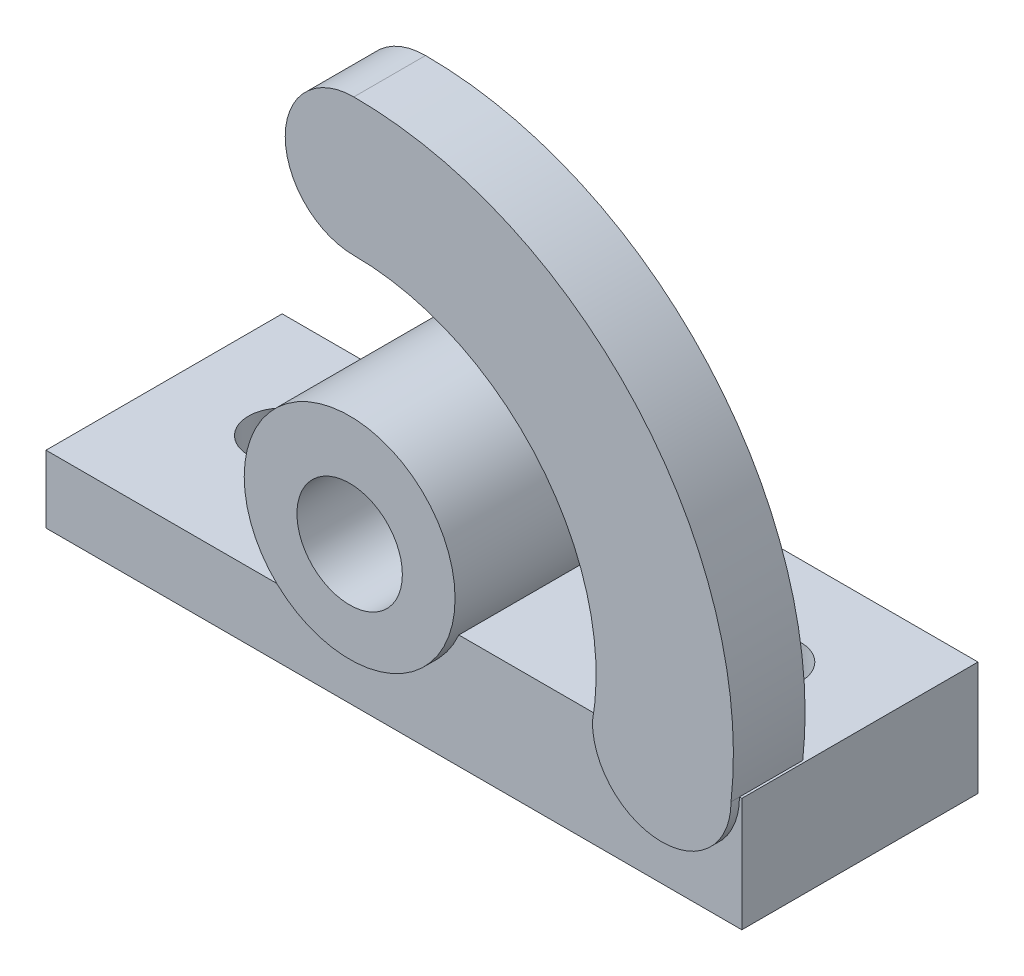
ISO-10303-21;
HEADER;
FILE_DESCRIPTION(('STEP AP214'),'2;1');
FILE_NAME('part.step','',(''),(''),'','','');
FILE_SCHEMA(('AUTOMOTIVE_DESIGN { 1 0 10303 214 1 1 1 1 }'));
ENDSEC;
DATA;
#1=APPLICATION_CONTEXT('core data for automotive mechanical design processes');
#2=APPLICATION_PROTOCOL_DEFINITION('international standard','automotive_design',2000,#1);
#3=PRODUCT_CONTEXT('',#1,'mechanical');
#4=PRODUCT('Part','Part','',(#3));
#5=PRODUCT_RELATED_PRODUCT_CATEGORY('part','',(#4));
#6=PRODUCT_DEFINITION_FORMATION('','',#4);
#7=PRODUCT_DEFINITION_CONTEXT('part definition',#1,'design');
#8=PRODUCT_DEFINITION('design','',#6,#7);
#9=PRODUCT_DEFINITION_SHAPE('','',#8);
#10=(LENGTH_UNIT() NAMED_UNIT(*) SI_UNIT(.MILLI.,.METRE.));
#11=(NAMED_UNIT(*) PLANE_ANGLE_UNIT() SI_UNIT($,.RADIAN.));
#12=(NAMED_UNIT(*) SI_UNIT($,.STERADIAN.) SOLID_ANGLE_UNIT());
#13=UNCERTAINTY_MEASURE_WITH_UNIT(LENGTH_MEASURE(1.E-05),#10,'distance_accuracy_value','');
#14=(GEOMETRIC_REPRESENTATION_CONTEXT(3) GLOBAL_UNCERTAINTY_ASSIGNED_CONTEXT((#13)) GLOBAL_UNIT_ASSIGNED_CONTEXT((#10,
#11,#12)) REPRESENTATION_CONTEXT('',''));
#15=CARTESIAN_POINT('',(0.,0.,0.));
#16=DIRECTION('',(0.,0.,1.));
#17=DIRECTION('',(1.,0.,0.));
#18=AXIS2_PLACEMENT_3D('',#15,#16,#17);
#19=CARTESIAN_POINT('',(0.,27.,0.));
#20=DIRECTION('',(0.,-1.,0.));
#21=DIRECTION('',(0.,0.,-1.));
#22=AXIS2_PLACEMENT_3D('',#19,#20,#21);
#23=PLANE('',#22);
#24=CARTESIAN_POINT('',(140.,27.,-31.));
#25=DIRECTION('',(0.,1.,0.));
#26=DIRECTION('',(0.,0.,1.));
#27=AXIS2_PLACEMENT_3D('',#24,#25,#26);
#28=CIRCLE('',#27,8.00000000000001);
#29=CARTESIAN_POINT('',(140.,27.,-23.));
#30=VERTEX_POINT('',#29);
#31=EDGE_CURVE('E167',#30,#30,#28,.T.);
#32=ORIENTED_EDGE('',*,*,#31,.F.);
#33=EDGE_LOOP('',(#32));
#34=FACE_BOUND('',#33,.T.);
#35=DIRECTION('',(0.,0.,-1.));
#36=VECTOR('',#35,1.);
#37=CARTESIAN_POINT('',(131.562583971721,27.,2.));
#38=LINE('',#37,#36);
#39=CARTESIAN_POINT('',(131.562583971721,27.,-15.));
#40=VERTEX_POINT('',#39);
#41=CARTESIAN_POINT('',(131.562583971721,27.,0.));
#42=VERTEX_POINT('',#41);
#43=EDGE_CURVE('E12',#40,#42,#38,.F.);
#44=ORIENTED_EDGE('',*,*,#43,.F.);
#45=DIRECTION('',(-1.,0.,0.));
#46=VECTOR('',#45,1.);
#47=CARTESIAN_POINT('',(0.,27.,-15.));
#48=LINE('',#47,#46);
#49=CARTESIAN_POINT('',(164.437416028279,27.,-15.));
#50=VERTEX_POINT('',#49);
#51=EDGE_CURVE('E54',#50,#40,#48,.T.);
#52=ORIENTED_EDGE('',*,*,#51,.F.);
#53=DIRECTION('',(0.,0.,-1.));
#54=VECTOR('',#53,1.);
#55=CARTESIAN_POINT('',(164.437416028279,27.,2.));
#56=LINE('',#55,#54);
#57=CARTESIAN_POINT('',(164.437416028279,27.,0.));
#58=VERTEX_POINT('',#57);
#59=EDGE_CURVE('E47',#58,#50,#56,.T.);
#60=ORIENTED_EDGE('',*,*,#59,.F.);
#61=DIRECTION('',(1.,0.,0.));
#62=VECTOR('',#61,1.);
#63=CARTESIAN_POINT('',(165.,27.,0.));
#64=LINE('',#63,#62);
#65=CARTESIAN_POINT('',(165.,27.,0.));
#66=VERTEX_POINT('',#65);
#67=EDGE_CURVE('E170',#58,#66,#64,.T.);
#68=ORIENTED_EDGE('',*,*,#67,.T.);
#69=DIRECTION('',(0.,0.,-1.));
#70=VECTOR('',#69,1.);
#71=CARTESIAN_POINT('',(165.,27.,-56.));
#72=LINE('',#71,#70);
#73=CARTESIAN_POINT('',(165.,27.,-56.));
#74=VERTEX_POINT('',#73);
#75=EDGE_CURVE('E174',#66,#74,#72,.T.);
#76=ORIENTED_EDGE('',*,*,#75,.T.);
#77=DIRECTION('',(-1.,0.,0.));
#78=VECTOR('',#77,1.);
#79=CARTESIAN_POINT('',(88.4911220135144,27.,-56.));
#80=LINE('',#79,#78);
#81=CARTESIAN_POINT('',(97.8921686568885,27.,-56.));
#82=VERTEX_POINT('',#81);
#83=EDGE_CURVE('E177',#74,#82,#80,.T.);
#84=ORIENTED_EDGE('',*,*,#83,.T.);
#85=DIRECTION('',(0.,0.,-1.));
#86=VECTOR('',#85,1.);
#87=CARTESIAN_POINT('',(97.8921686568885,27.,3.));
#88=LINE('',#87,#86);
#89=CARTESIAN_POINT('',(97.8921686568885,27.,0.));
#90=VERTEX_POINT('',#89);
#91=EDGE_CURVE('E243',#82,#90,#88,.F.);
#92=ORIENTED_EDGE('',*,*,#91,.T.);
#93=EDGE_CURVE('E171',#90,#42,#64,.T.);
#94=ORIENTED_EDGE('',*,*,#93,.T.);
#95=EDGE_LOOP('',(#44,#52,#60,#68,#76,#84,#92,#94));
#96=FACE_BOUND('',#95,.T.);
#97=ADVANCED_FACE('F39',(#34,#96),#23,.F.);
#98=CARTESIAN_POINT('',(75.,37.0473187559952,3.));
#99=DIRECTION('',(0.,0.,-1.));
#100=DIRECTION('',(-1.,0.,0.));
#101=AXIS2_PLACEMENT_3D('',#98,#99,#100);
#102=CYLINDRICAL_SURFACE('',#101,25.);
#103=CARTESIAN_POINT('',(75.,37.0473187559952,-59.));
#104=DIRECTION('',(0.,0.,1.));
#105=DIRECTION('',(1.,0.,0.));
#106=AXIS2_PLACEMENT_3D('',#103,#104,#105);
#107=CIRCLE('',#106,25.);
#108=CARTESIAN_POINT('',(100.,37.0473187559952,-59.));
#109=VERTEX_POINT('',#108);
#110=EDGE_CURVE('E184',#109,#109,#107,.T.);
#111=ORIENTED_EDGE('',*,*,#110,.T.);
#112=EDGE_LOOP('',(#111));
#113=FACE_BOUND('',#112,.T.);
#114=CARTESIAN_POINT('',(75.,37.0473187559952,3.));
#115=DIRECTION('',(0.,0.,1.));
#116=DIRECTION('',(1.,0.,0.));
#117=AXIS2_PLACEMENT_3D('',#114,#115,#116);
#118=CIRCLE('',#117,25.);
#119=CARTESIAN_POINT('',(100.,37.0473187559952,3.));
#120=VERTEX_POINT('',#119);
#121=EDGE_CURVE('E189',#120,#120,#118,.T.);
#122=ORIENTED_EDGE('',*,*,#121,.F.);
#123=EDGE_LOOP('',(#122));
#124=FACE_BOUND('',#123,.T.);
#125=CARTESIAN_POINT('',(75.,37.0473187559952,0.));
#126=DIRECTION('',(0.,0.,-1.));
#127=DIRECTION('',(-1.,0.,0.));
#128=AXIS2_PLACEMENT_3D('',#125,#126,#127);
#129=CIRCLE('',#128,25.);
#130=CARTESIAN_POINT('',(57.2811632890543,19.4109125004441,0.));
#131=VERTEX_POINT('',#130);
#132=EDGE_CURVE('E194',#131,#90,#129,.F.);
#133=ORIENTED_EDGE('',*,*,#132,.T.);
#134=ORIENTED_EDGE('',*,*,#91,.F.);
#135=CARTESIAN_POINT('',(75.,37.0473187559952,-56.));
#136=DIRECTION('',(0.,0.,1.));
#137=DIRECTION('',(1.,0.,0.));
#138=AXIS2_PLACEMENT_3D('',#135,#136,#137);
#139=CIRCLE('',#138,25.);
#140=CARTESIAN_POINT('',(57.2811632890543,19.4109125004441,-56.));
#141=VERTEX_POINT('',#140);
#142=EDGE_CURVE('E192',#82,#141,#139,.F.);
#143=ORIENTED_EDGE('',*,*,#142,.T.);
#144=DIRECTION('',(0.,0.,-1.));
#145=VECTOR('',#144,1.);
#146=CARTESIAN_POINT('',(57.2811632890543,19.4109125004441,3.));
#147=LINE('',#146,#145);
#148=EDGE_CURVE('E233',#141,#131,#147,.F.);
#149=ORIENTED_EDGE('',*,*,#148,.T.);
#150=EDGE_LOOP('',(#133,#134,#143,#149));
#151=FACE_BOUND('',#150,.T.);
#152=ADVANCED_FACE('F260',(#113,#124,#151),#102,.T.);
#153=CARTESIAN_POINT('',(0.,16.,0.));
#154=DIRECTION('',(0.,-1.,0.));
#155=DIRECTION('',(0.,0.,-1.));
#156=AXIS2_PLACEMENT_3D('',#153,#154,#155);
#157=PLANE('',#156);
#158=CARTESIAN_POINT('',(25.,16.,-31.));
#159=DIRECTION('',(0.,1.,0.));
#160=DIRECTION('',(0.,0.,1.));
#161=AXIS2_PLACEMENT_3D('',#158,#159,#160);
#162=CIRCLE('',#161,8.);
#163=CARTESIAN_POINT('',(25.,16.,-23.));
#164=VERTEX_POINT('',#163);
#165=EDGE_CURVE('E201',#164,#164,#162,.T.);
#166=ORIENTED_EDGE('',*,*,#165,.F.);
#167=EDGE_LOOP('',(#166));
#168=FACE_BOUND('',#167,.T.);
#169=DIRECTION('',(1.,0.,0.));
#170=VECTOR('',#169,1.);
#171=CARTESIAN_POINT('',(165.,16.,0.));
#172=LINE('',#171,#170);
#173=CARTESIAN_POINT('',(0.,16.,0.));
#174=VERTEX_POINT('',#173);
#175=CARTESIAN_POINT('',(55.8636563521787,16.,0.));
#176=VERTEX_POINT('',#175);
#177=EDGE_CURVE('E206',#174,#176,#172,.T.);
#178=ORIENTED_EDGE('',*,*,#177,.T.);
#179=DIRECTION('',(0.,0.,1.));
#180=VECTOR('',#179,1.);
#181=CARTESIAN_POINT('',(55.8636563521787,16.,-56.));
#182=LINE('',#181,#180);
#183=CARTESIAN_POINT('',(55.8636563521787,16.,-56.));
#184=VERTEX_POINT('',#183);
#185=EDGE_CURVE('E236',#176,#184,#182,.F.);
#186=ORIENTED_EDGE('',*,*,#185,.T.);
#187=DIRECTION('',(-1.,0.,0.));
#188=VECTOR('',#187,1.);
#189=CARTESIAN_POINT('',(0.,16.,-56.));
#190=LINE('',#189,#188);
#191=CARTESIAN_POINT('',(0.,16.,-56.));
#192=VERTEX_POINT('',#191);
#193=EDGE_CURVE('E209',#184,#192,#190,.T.);
#194=ORIENTED_EDGE('',*,*,#193,.T.);
#195=DIRECTION('',(0.,0.,1.));
#196=VECTOR('',#195,1.);
#197=CARTESIAN_POINT('',(0.,16.,0.));
#198=LINE('',#197,#196);
#199=EDGE_CURVE('E212',#192,#174,#198,.T.);
#200=ORIENTED_EDGE('',*,*,#199,.T.);
#201=EDGE_LOOP('',(#178,#186,#194,#200));
#202=FACE_BOUND('',#201,.T.);
#203=ADVANCED_FACE('F269',(#168,#202),#157,.F.);
#204=CARTESIAN_POINT('',(165.,16.,0.));
#205=DIRECTION('',(0.,0.,-1.));
#206=DIRECTION('',(-1.,0.,0.));
#207=AXIS2_PLACEMENT_3D('',#204,#205,#206);
#208=PLANE('',#207);
#209=CARTESIAN_POINT('',(148.,27.,0.));
#210=DIRECTION('',(0.,0.,-1.));
#211=DIRECTION('',(-1.,0.,0.));
#212=AXIS2_PLACEMENT_3D('',#209,#210,#211);
#213=CIRCLE('',#212,16.4374160282788);
#214=EDGE_CURVE('E135',#42,#58,#213,.F.);
#215=ORIENTED_EDGE('',*,*,#214,.F.);
#216=ORIENTED_EDGE('',*,*,#93,.F.);
#217=ORIENTED_EDGE('',*,*,#132,.F.);
#218=CARTESIAN_POINT('',(55.8636563521787,18.,0.));
#219=DIRECTION('',(0.,0.,-1.));
#220=DIRECTION('',(-1.,0.,0.));
#221=AXIS2_PLACEMENT_3D('',#218,#219,#220);
#222=CIRCLE('',#221,2.);
#223=EDGE_CURVE('E238',#131,#176,#222,.T.);
#224=ORIENTED_EDGE('',*,*,#223,.T.);
#225=ORIENTED_EDGE('',*,*,#177,.F.);
#226=DIRECTION('',(0.,-1.,0.));
#227=VECTOR('',#226,1.);
#228=CARTESIAN_POINT('',(0.,16.,0.));
#229=LINE('',#228,#227);
#230=CARTESIAN_POINT('',(0.,0.,0.));
#231=VERTEX_POINT('',#230);
#232=EDGE_CURVE('E214',#174,#231,#229,.T.);
#233=ORIENTED_EDGE('',*,*,#232,.T.);
#234=DIRECTION('',(1.,0.,0.));
#235=VECTOR('',#234,1.);
#236=CARTESIAN_POINT('',(165.,0.,0.));
#237=LINE('',#236,#235);
#238=CARTESIAN_POINT('',(165.,0.,0.));
#239=VERTEX_POINT('',#238);
#240=EDGE_CURVE('E200',#231,#239,#237,.T.);
#241=ORIENTED_EDGE('',*,*,#240,.T.);
#242=DIRECTION('',(0.,-1.,0.));
#243=VECTOR('',#242,1.);
#244=CARTESIAN_POINT('',(165.,16.,0.));
#245=LINE('',#244,#243);
#246=EDGE_CURVE('E230',#66,#239,#245,.T.);
#247=ORIENTED_EDGE('',*,*,#246,.F.);
#248=ORIENTED_EDGE('',*,*,#67,.F.);
#249=EDGE_LOOP('',(#215,#216,#217,#224,#225,#233,#241,#247,#248));
#250=FACE_BOUND('',#249,.T.);
#251=ADVANCED_FACE('F255',(#250),#208,.F.);
#252=CARTESIAN_POINT('',(165.,16.,-56.));
#253=DIRECTION('',(-1.,0.,0.));
#254=DIRECTION('',(0.,0.,1.));
#255=AXIS2_PLACEMENT_3D('',#252,#253,#254);
#256=PLANE('',#255);
#257=DIRECTION('',(0.,0.,-1.));
#258=VECTOR('',#257,1.);
#259=CARTESIAN_POINT('',(165.,0.,-56.));
#260=LINE('',#259,#258);
#261=CARTESIAN_POINT('',(165.,0.,-56.));
#262=VERTEX_POINT('',#261);
#263=EDGE_CURVE('E217',#239,#262,#260,.T.);
#264=ORIENTED_EDGE('',*,*,#263,.T.);
#265=DIRECTION('',(0.,-1.,0.));
#266=VECTOR('',#265,1.);
#267=CARTESIAN_POINT('',(165.,16.,-56.));
#268=LINE('',#267,#266);
#269=EDGE_CURVE('E227',#74,#262,#268,.T.);
#270=ORIENTED_EDGE('',*,*,#269,.F.);
#271=ORIENTED_EDGE('',*,*,#75,.F.);
#272=ORIENTED_EDGE('',*,*,#246,.T.);
#273=EDGE_LOOP('',(#264,#270,#271,#272));
#274=FACE_BOUND('',#273,.T.);
#275=ADVANCED_FACE('F284',(#274),#256,.F.);
#276=CARTESIAN_POINT('',(0.,16.,-56.));
#277=DIRECTION('',(0.,0.,1.));
#278=DIRECTION('',(1.,0.,0.));
#279=AXIS2_PLACEMENT_3D('',#276,#277,#278);
#280=PLANE('',#279);
#281=ORIENTED_EDGE('',*,*,#142,.F.);
#282=ORIENTED_EDGE('',*,*,#83,.F.);
#283=ORIENTED_EDGE('',*,*,#269,.T.);
#284=DIRECTION('',(-1.,0.,0.));
#285=VECTOR('',#284,1.);
#286=CARTESIAN_POINT('',(0.,0.,-56.));
#287=LINE('',#286,#285);
#288=CARTESIAN_POINT('',(0.,0.,-56.));
#289=VERTEX_POINT('',#288);
#290=EDGE_CURVE('E219',#262,#289,#287,.T.);
#291=ORIENTED_EDGE('',*,*,#290,.T.);
#292=DIRECTION('',(0.,-1.,0.));
#293=VECTOR('',#292,1.);
#294=CARTESIAN_POINT('',(0.,16.,-56.));
#295=LINE('',#294,#293);
#296=EDGE_CURVE('E224',#192,#289,#295,.T.);
#297=ORIENTED_EDGE('',*,*,#296,.F.);
#298=ORIENTED_EDGE('',*,*,#193,.F.);
#299=CARTESIAN_POINT('',(55.8636563521787,18.,-56.));
#300=DIRECTION('',(0.,0.,1.));
#301=DIRECTION('',(1.,0.,0.));
#302=AXIS2_PLACEMENT_3D('',#299,#300,#301);
#303=CIRCLE('',#302,2.);
#304=EDGE_CURVE('E240',#184,#141,#303,.T.);
#305=ORIENTED_EDGE('',*,*,#304,.T.);
#306=EDGE_LOOP('',(#281,#282,#283,#291,#297,#298,#305));
#307=FACE_BOUND('',#306,.T.);
#308=ADVANCED_FACE('F272',(#307),#280,.F.);
#309=CARTESIAN_POINT('',(0.,16.,0.));
#310=DIRECTION('',(1.,0.,0.));
#311=DIRECTION('',(0.,0.,-1.));
#312=AXIS2_PLACEMENT_3D('',#309,#310,#311);
#313=PLANE('',#312);
#314=DIRECTION('',(0.,0.,1.));
#315=VECTOR('',#314,1.);
#316=CARTESIAN_POINT('',(0.,0.,0.));
#317=LINE('',#316,#315);
#318=EDGE_CURVE('E210',#289,#231,#317,.T.);
#319=ORIENTED_EDGE('',*,*,#318,.T.);
#320=ORIENTED_EDGE('',*,*,#232,.F.);
#321=ORIENTED_EDGE('',*,*,#199,.F.);
#322=ORIENTED_EDGE('',*,*,#296,.T.);
#323=EDGE_LOOP('',(#319,#320,#321,#322));
#324=FACE_BOUND('',#323,.T.);
#325=ADVANCED_FACE('F278',(#324),#313,.F.);
#326=CARTESIAN_POINT('',(0.,0.,0.));
#327=DIRECTION('',(0.,-1.,0.));
#328=DIRECTION('',(0.,0.,-1.));
#329=AXIS2_PLACEMENT_3D('',#326,#327,#328);
#330=PLANE('',#329);
#331=CARTESIAN_POINT('',(25.,0.,-31.));
#332=DIRECTION('',(0.,1.,0.));
#333=DIRECTION('',(0.,0.,1.));
#334=AXIS2_PLACEMENT_3D('',#331,#332,#333);
#335=CIRCLE('',#334,8.);
#336=CARTESIAN_POINT('',(25.,0.,-23.));
#337=VERTEX_POINT('',#336);
#338=EDGE_CURVE('E197',#337,#337,#335,.T.);
#339=ORIENTED_EDGE('',*,*,#338,.T.);
#340=EDGE_LOOP('',(#339));
#341=FACE_BOUND('',#340,.T.);
#342=CARTESIAN_POINT('',(140.,0.,-31.));
#343=DIRECTION('',(0.,1.,0.));
#344=DIRECTION('',(0.,0.,1.));
#345=AXIS2_PLACEMENT_3D('',#342,#343,#344);
#346=CIRCLE('',#345,8.00000000000001);
#347=CARTESIAN_POINT('',(140.,0.,-23.));
#348=VERTEX_POINT('',#347);
#349=EDGE_CURVE('E196',#348,#348,#346,.T.);
#350=ORIENTED_EDGE('',*,*,#349,.T.);
#351=EDGE_LOOP('',(#350));
#352=FACE_BOUND('',#351,.T.);
#353=ORIENTED_EDGE('',*,*,#240,.F.);
#354=ORIENTED_EDGE('',*,*,#318,.F.);
#355=ORIENTED_EDGE('',*,*,#290,.F.);
#356=ORIENTED_EDGE('',*,*,#263,.F.);
#357=EDGE_LOOP('',(#353,#354,#355,#356));
#358=FACE_BOUND('',#357,.T.);
#359=ADVANCED_FACE('F281',(#341,#352,#358),#330,.T.);
#360=CARTESIAN_POINT('',(140.,0.,-31.));
#361=DIRECTION('',(0.,1.,0.));
#362=DIRECTION('',(0.,0.,1.));
#363=AXIS2_PLACEMENT_3D('',#360,#361,#362);
#364=CYLINDRICAL_SURFACE('',#363,8.00000000000001);
#365=ORIENTED_EDGE('',*,*,#349,.F.);
#366=EDGE_LOOP('',(#365));
#367=FACE_BOUND('',#366,.T.);
#368=ORIENTED_EDGE('',*,*,#31,.T.);
#369=EDGE_LOOP('',(#368));
#370=FACE_BOUND('',#369,.T.);
#371=ADVANCED_FACE('F319',(#367,#370),#364,.F.);
#372=CARTESIAN_POINT('',(25.,0.,-31.));
#373=DIRECTION('',(0.,1.,0.));
#374=DIRECTION('',(0.,0.,1.));
#375=AXIS2_PLACEMENT_3D('',#372,#373,#374);
#376=CYLINDRICAL_SURFACE('',#375,8.);
#377=ORIENTED_EDGE('',*,*,#338,.F.);
#378=EDGE_LOOP('',(#377));
#379=FACE_BOUND('',#378,.T.);
#380=ORIENTED_EDGE('',*,*,#165,.T.);
#381=EDGE_LOOP('',(#380));
#382=FACE_BOUND('',#381,.T.);
#383=ADVANCED_FACE('F314',(#379,#382),#376,.F.);
#384=CARTESIAN_POINT('',(75.,37.0473187559952,3.));
#385=DIRECTION('',(0.,0.,1.));
#386=DIRECTION('',(1.,0.,0.));
#387=AXIS2_PLACEMENT_3D('',#384,#385,#386);
#388=PLANE('',#387);
#389=CARTESIAN_POINT('',(75.,35.7136601642205,3.));
#390=DIRECTION('',(0.,0.,1.));
#391=DIRECTION('',(1.,0.,0.));
#392=AXIS2_PLACEMENT_3D('',#389,#390,#391);
#393=CIRCLE('',#392,12.5);
#394=CARTESIAN_POINT('',(87.5,35.7136601642205,3.));
#395=VERTEX_POINT('',#394);
#396=EDGE_CURVE('E180',#395,#395,#393,.T.);
#397=ORIENTED_EDGE('',*,*,#396,.F.);
#398=EDGE_LOOP('',(#397));
#399=FACE_BOUND('',#398,.T.);
#400=ORIENTED_EDGE('',*,*,#121,.T.);
#401=EDGE_LOOP('',(#400));
#402=FACE_BOUND('',#401,.T.);
#403=ADVANCED_FACE('F311',(#399,#402),#388,.T.);
#404=CARTESIAN_POINT('',(75.,37.0473187559952,-59.));
#405=DIRECTION('',(0.,0.,1.));
#406=DIRECTION('',(1.,0.,0.));
#407=AXIS2_PLACEMENT_3D('',#404,#405,#406);
#408=PLANE('',#407);
#409=CARTESIAN_POINT('',(75.,35.7136601642205,-59.));
#410=DIRECTION('',(0.,0.,1.));
#411=DIRECTION('',(1.,0.,0.));
#412=AXIS2_PLACEMENT_3D('',#409,#410,#411);
#413=CIRCLE('',#412,12.5);
#414=CARTESIAN_POINT('',(87.5,35.7136601642205,-59.));
#415=VERTEX_POINT('',#414);
#416=EDGE_CURVE('E181',#415,#415,#413,.T.);
#417=ORIENTED_EDGE('',*,*,#416,.T.);
#418=EDGE_LOOP('',(#417));
#419=FACE_BOUND('',#418,.T.);
#420=ORIENTED_EDGE('',*,*,#110,.F.);
#421=EDGE_LOOP('',(#420));
#422=FACE_BOUND('',#421,.T.);
#423=ADVANCED_FACE('F308',(#419,#422),#408,.F.);
#424=CARTESIAN_POINT('',(55.8636563521787,18.,3.));
#425=DIRECTION('',(0.,0.,-1.));
#426=DIRECTION('',(-1.,0.,0.));
#427=AXIS2_PLACEMENT_3D('',#424,#425,#426);
#428=CYLINDRICAL_SURFACE('',#427,2.);
#429=ORIENTED_EDGE('',*,*,#304,.F.);
#430=ORIENTED_EDGE('',*,*,#185,.F.);
#431=ORIENTED_EDGE('',*,*,#223,.F.);
#432=ORIENTED_EDGE('',*,*,#148,.F.);
#433=EDGE_LOOP('',(#429,#430,#431,#432));
#434=FACE_BOUND('',#433,.T.);
#435=ADVANCED_FACE('F41',(#434),#428,.F.);
#436=CARTESIAN_POINT('',(75.,35.7136601642205,-59.));
#437=DIRECTION('',(0.,0.,1.));
#438=DIRECTION('',(1.,0.,0.));
#439=AXIS2_PLACEMENT_3D('',#436,#437,#438);
#440=CYLINDRICAL_SURFACE('',#439,12.5);
#441=ORIENTED_EDGE('',*,*,#416,.F.);
#442=EDGE_LOOP('',(#441));
#443=FACE_BOUND('',#442,.T.);
#444=ORIENTED_EDGE('',*,*,#396,.T.);
#445=EDGE_LOOP('',(#444));
#446=FACE_BOUND('',#445,.T.);
#447=ADVANCED_FACE('F304',(#443,#446),#440,.F.);
#448=CARTESIAN_POINT('',(148.,27.,2.));
#449=DIRECTION('',(0.,0.,-1.));
#450=DIRECTION('',(-1.,0.,0.));
#451=AXIS2_PLACEMENT_3D('',#448,#449,#450);
#452=CYLINDRICAL_SURFACE('',#451,16.4374160282788);
#453=DIRECTION('',(0.,0.,-1.));
#454=VECTOR('',#453,1.);
#455=CARTESIAN_POINT('',(131.562583971721,27.,2.));
#456=LINE('',#455,#454);
#457=CARTESIAN_POINT('',(131.562583971721,27.,2.));
#458=VERTEX_POINT('',#457);
#459=EDGE_CURVE('E136',#458,#42,#456,.T.);
#460=ORIENTED_EDGE('',*,*,#459,.T.);
#461=ORIENTED_EDGE('',*,*,#214,.T.);
#462=DIRECTION('',(0.,0.,-1.));
#463=VECTOR('',#462,1.);
#464=CARTESIAN_POINT('',(164.437416028279,27.,2.));
#465=LINE('',#464,#463);
#466=CARTESIAN_POINT('',(164.437416028279,27.,2.));
#467=VERTEX_POINT('',#466);
#468=EDGE_CURVE('E160',#467,#58,#465,.T.);
#469=ORIENTED_EDGE('',*,*,#468,.F.);
#470=CARTESIAN_POINT('',(148.,27.,2.));
#471=DIRECTION('',(0.,0.,1.));
#472=DIRECTION('',(1.,0.,0.));
#473=AXIS2_PLACEMENT_3D('',#470,#471,#472);
#474=CIRCLE('',#473,16.4374160282788);
#475=EDGE_CURVE('E155',#458,#467,#474,.T.);
#476=ORIENTED_EDGE('',*,*,#475,.F.);
#477=EDGE_LOOP('',(#460,#461,#469,#476));
#478=FACE_BOUND('',#477,.T.);
#479=ADVANCED_FACE('F252',(#478),#452,.T.);
#480=CARTESIAN_POINT('',(75.,73.9093227068341,-15.));
#481=DIRECTION('',(0.,0.,1.));
#482=DIRECTION('',(1.,0.,0.));
#483=AXIS2_PLACEMENT_3D('',#480,#481,#482);
#484=PLANE('',#483);
#485=CARTESIAN_POINT('',(75.,37.0473187559952,-15.));
#486=DIRECTION('',(0.,0.,1.));
#487=DIRECTION('',(-1.,0.,0.));
#488=AXIS2_PLACEMENT_3D('',#485,#486,#487);
#489=CIRCLE('',#488,90.);
#490=CARTESIAN_POINT('',(75.,127.047318755995,-15.));
#491=VERTEX_POINT('',#490);
#492=EDGE_CURVE('E144',#50,#491,#489,.T.);
#493=ORIENTED_EDGE('',*,*,#492,.F.);
#494=ORIENTED_EDGE('',*,*,#51,.T.);
#495=CARTESIAN_POINT('',(75.,37.0473187559952,-15.));
#496=DIRECTION('',(0.,0.,-1.));
#497=DIRECTION('',(-1.,0.,0.));
#498=AXIS2_PLACEMENT_3D('',#495,#496,#497);
#499=CIRCLE('',#498,57.4480158033555);
#500=CARTESIAN_POINT('',(75.,94.4953345593507,-15.));
#501=VERTEX_POINT('',#500);
#502=EDGE_CURVE('E128',#501,#40,#499,.T.);
#503=ORIENTED_EDGE('',*,*,#502,.F.);
#504=CARTESIAN_POINT('',(75.,110.771326657673,-15.));
#505=DIRECTION('',(0.,0.,1.));
#506=DIRECTION('',(1.,0.,0.));
#507=AXIS2_PLACEMENT_3D('',#504,#505,#506);
#508=CIRCLE('',#507,16.2759920983223);
#509=EDGE_CURVE('E142',#491,#501,#508,.T.);
#510=ORIENTED_EDGE('',*,*,#509,.F.);
#511=EDGE_LOOP('',(#493,#494,#503,#510));
#512=FACE_BOUND('',#511,.T.);
#513=ADVANCED_FACE('F141',(#512),#484,.F.);
#514=CARTESIAN_POINT('',(75.,110.771326657673,2.));
#515=DIRECTION('',(0.,0.,-1.));
#516=DIRECTION('',(-1.,0.,0.));
#517=AXIS2_PLACEMENT_3D('',#514,#515,#516);
#518=CYLINDRICAL_SURFACE('',#517,16.2759920983223);
#519=DIRECTION('',(0.,0.,-1.));
#520=VECTOR('',#519,1.);
#521=CARTESIAN_POINT('',(75.,127.047318755995,2.));
#522=LINE('',#521,#520);
#523=CARTESIAN_POINT('',(75.,127.047318755995,2.));
#524=VERTEX_POINT('',#523);
#525=EDGE_CURVE('E148',#524,#491,#522,.T.);
#526=ORIENTED_EDGE('',*,*,#525,.T.);
#527=ORIENTED_EDGE('',*,*,#509,.T.);
#528=DIRECTION('',(0.,0.,-1.));
#529=VECTOR('',#528,1.);
#530=CARTESIAN_POINT('',(75.,94.4953345593507,2.));
#531=LINE('',#530,#529);
#532=CARTESIAN_POINT('',(75.,94.4953345593507,2.));
#533=VERTEX_POINT('',#532);
#534=EDGE_CURVE('E125',#533,#501,#531,.T.);
#535=ORIENTED_EDGE('',*,*,#534,.F.);
#536=CARTESIAN_POINT('',(75.,110.771326657673,2.));
#537=DIRECTION('',(0.,0.,1.));
#538=DIRECTION('',(1.,0.,0.));
#539=AXIS2_PLACEMENT_3D('',#536,#537,#538);
#540=CIRCLE('',#539,16.2759920983223);
#541=EDGE_CURVE('E152',#524,#533,#540,.T.);
#542=ORIENTED_EDGE('',*,*,#541,.F.);
#543=EDGE_LOOP('',(#526,#527,#535,#542));
#544=FACE_BOUND('',#543,.T.);
#545=ADVANCED_FACE('F146',(#544),#518,.T.);
#546=CARTESIAN_POINT('',(75.,37.0473187559952,2.));
#547=DIRECTION('',(0.,0.,-1.));
#548=DIRECTION('',(-1.,0.,0.));
#549=AXIS2_PLACEMENT_3D('',#546,#547,#548);
#550=CYLINDRICAL_SURFACE('',#549,57.4480158033555);
#551=ORIENTED_EDGE('',*,*,#534,.T.);
#552=ORIENTED_EDGE('',*,*,#502,.T.);
#553=ORIENTED_EDGE('',*,*,#43,.T.);
#554=ORIENTED_EDGE('',*,*,#459,.F.);
#555=CARTESIAN_POINT('',(75.,37.0473187559952,2.));
#556=DIRECTION('',(0.,0.,-1.));
#557=DIRECTION('',(-1.,0.,0.));
#558=AXIS2_PLACEMENT_3D('',#555,#556,#557);
#559=CIRCLE('',#558,57.4480158033555);
#560=EDGE_CURVE('E130',#533,#458,#559,.T.);
#561=ORIENTED_EDGE('',*,*,#560,.F.);
#562=EDGE_LOOP('',(#551,#552,#553,#554,#561));
#563=FACE_BOUND('',#562,.T.);
#564=ADVANCED_FACE('F127',(#563),#550,.F.);
#565=CARTESIAN_POINT('',(75.,37.0473187559952,2.));
#566=DIRECTION('',(0.,0.,-1.));
#567=DIRECTION('',(-1.,0.,0.));
#568=AXIS2_PLACEMENT_3D('',#565,#566,#567);
#569=CYLINDRICAL_SURFACE('',#568,90.);
#570=ORIENTED_EDGE('',*,*,#468,.T.);
#571=ORIENTED_EDGE('',*,*,#59,.T.);
#572=ORIENTED_EDGE('',*,*,#492,.T.);
#573=ORIENTED_EDGE('',*,*,#525,.F.);
#574=CARTESIAN_POINT('',(75.,37.0473187559952,2.));
#575=DIRECTION('',(0.,0.,1.));
#576=DIRECTION('',(-1.,0.,0.));
#577=AXIS2_PLACEMENT_3D('',#574,#575,#576);
#578=CIRCLE('',#577,90.);
#579=EDGE_CURVE('E157',#467,#524,#578,.T.);
#580=ORIENTED_EDGE('',*,*,#579,.F.);
#581=EDGE_LOOP('',(#570,#571,#572,#573,#580));
#582=FACE_BOUND('',#581,.T.);
#583=ADVANCED_FACE('F247',(#582),#569,.T.);
#584=CARTESIAN_POINT('',(75.,73.9093227068341,2.));
#585=DIRECTION('',(0.,0.,1.));
#586=DIRECTION('',(1.,0.,0.));
#587=AXIS2_PLACEMENT_3D('',#584,#585,#586);
#588=PLANE('',#587);
#589=ORIENTED_EDGE('',*,*,#541,.T.);
#590=ORIENTED_EDGE('',*,*,#560,.T.);
#591=ORIENTED_EDGE('',*,*,#475,.T.);
#592=ORIENTED_EDGE('',*,*,#579,.T.);
#593=EDGE_LOOP('',(#589,#590,#591,#592));
#594=FACE_BOUND('',#593,.T.);
#595=ADVANCED_FACE('F395',(#594),#588,.T.);
#596=CLOSED_SHELL('',(#97,#152,#203,#251,#275,#308,#325,#359,#371,#383,#403,#423,#435,#447,#479,
#513,#545,#564,#583,#595));
#597=MANIFOLD_SOLID_BREP('B2',#596);
#598=ADVANCED_BREP_SHAPE_REPRESENTATION('',(#18,#597),#14);
#599=SHAPE_DEFINITION_REPRESENTATION(#9,#598);
ENDSEC;
END-ISO-10303-21;
